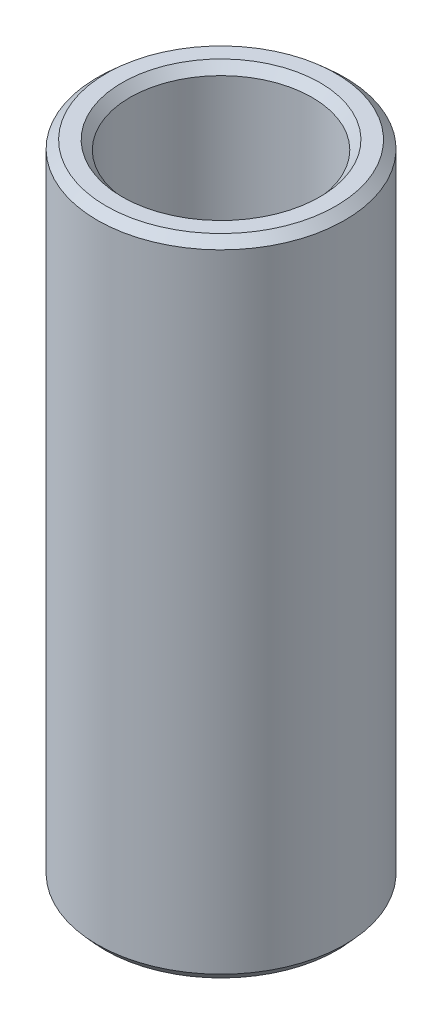
ISO-10303-21;
HEADER;
FILE_DESCRIPTION(('STEP AP214'),'2;1');
FILE_NAME('part.step','',(''),(''),'','','');
FILE_SCHEMA(('AUTOMOTIVE_DESIGN { 1 0 10303 214 1 1 1 1 }'));
ENDSEC;
DATA;
#1=APPLICATION_CONTEXT('core data for automotive mechanical design processes');
#2=APPLICATION_PROTOCOL_DEFINITION('international standard','automotive_design',2000,#1);
#3=PRODUCT_CONTEXT('',#1,'mechanical');
#4=PRODUCT('Part','Part','',(#3));
#5=PRODUCT_RELATED_PRODUCT_CATEGORY('part','',(#4));
#6=PRODUCT_DEFINITION_FORMATION('','',#4);
#7=PRODUCT_DEFINITION_CONTEXT('part definition',#1,'design');
#8=PRODUCT_DEFINITION('design','',#6,#7);
#9=PRODUCT_DEFINITION_SHAPE('','',#8);
#10=(LENGTH_UNIT() NAMED_UNIT(*) SI_UNIT(.MILLI.,.METRE.));
#11=(NAMED_UNIT(*) PLANE_ANGLE_UNIT() SI_UNIT($,.RADIAN.));
#12=(NAMED_UNIT(*) SI_UNIT($,.STERADIAN.) SOLID_ANGLE_UNIT());
#13=UNCERTAINTY_MEASURE_WITH_UNIT(LENGTH_MEASURE(1.E-05),#10,'distance_accuracy_value','');
#14=(GEOMETRIC_REPRESENTATION_CONTEXT(3) GLOBAL_UNCERTAINTY_ASSIGNED_CONTEXT((#13)) GLOBAL_UNIT_ASSIGNED_CONTEXT((#10,
#11,#12)) REPRESENTATION_CONTEXT('',''));
#15=CARTESIAN_POINT('',(0.,0.,0.));
#16=DIRECTION('',(0.,0.,1.));
#17=DIRECTION('',(1.,0.,0.));
#18=AXIS2_PLACEMENT_3D('',#15,#16,#17);
#19=CARTESIAN_POINT('',(0.,286.31339957584,0.));
#20=DIRECTION('',(0.,-1.,0.));
#21=DIRECTION('',(0.,0.,-1.));
#22=AXIS2_PLACEMENT_3D('',#19,#20,#21);
#23=CYLINDRICAL_SURFACE('',#22,55.);
#24=CARTESIAN_POINT('',(0.,3.92444573399153,0.));
#25=DIRECTION('',(0.,1.,0.));
#26=DIRECTION('',(0.,0.,1.));
#27=AXIS2_PLACEMENT_3D('',#24,#25,#26);
#28=CIRCLE('',#27,55.);
#29=CARTESIAN_POINT('',(0.,3.92444573399153,55.));
#30=VERTEX_POINT('',#29);
#31=EDGE_CURVE('E10',#30,#30,#28,.T.);
#32=ORIENTED_EDGE('',*,*,#31,.T.);
#33=EDGE_LOOP('',(#32));
#34=FACE_BOUND('',#33,.T.);
#35=CARTESIAN_POINT('',(0.,282.804681832681,0.));
#36=DIRECTION('',(0.,1.,0.));
#37=DIRECTION('',(0.,0.,1.));
#38=AXIS2_PLACEMENT_3D('',#35,#36,#37);
#39=CIRCLE('',#38,55.);
#40=CARTESIAN_POINT('',(0.,282.804681832681,55.));
#41=VERTEX_POINT('',#40);
#42=EDGE_CURVE('E50',#41,#41,#39,.F.);
#43=ORIENTED_EDGE('',*,*,#42,.T.);
#44=EDGE_LOOP('',(#43));
#45=FACE_BOUND('',#44,.T.);
#46=ADVANCED_FACE('F39',(#34,#45),#23,.T.);
#47=CARTESIAN_POINT('',(0.,286.31339957584,0.));
#48=DIRECTION('',(0.,1.,0.));
#49=DIRECTION('',(0.,0.,1.));
#50=AXIS2_PLACEMENT_3D('',#47,#48,#49);
#51=PLANE('',#50);
#52=CARTESIAN_POINT('',(0.,286.31339957584,0.));
#53=DIRECTION('',(0.,1.,0.));
#54=DIRECTION('',(0.,0.,1.));
#55=AXIS2_PLACEMENT_3D('',#52,#53,#54);
#56=CIRCLE('',#55,43.9866323589697);
#57=CARTESIAN_POINT('',(0.,286.31339957584,43.9866323589697));
#58=VERTEX_POINT('',#57);
#59=EDGE_CURVE('E58',#58,#58,#56,.F.);
#60=ORIENTED_EDGE('',*,*,#59,.T.);
#61=EDGE_LOOP('',(#60));
#62=FACE_BOUND('',#61,.T.);
#63=CARTESIAN_POINT('',(0.,286.31339957584,0.));
#64=DIRECTION('',(0.,1.,0.));
#65=DIRECTION('',(0.,0.,1.));
#66=AXIS2_PLACEMENT_3D('',#63,#64,#65);
#67=CIRCLE('',#66,51.0755542660083);
#68=CARTESIAN_POINT('',(0.,286.31339957584,51.0755542660083));
#69=VERTEX_POINT('',#68);
#70=EDGE_CURVE('E61',#69,#69,#67,.T.);
#71=ORIENTED_EDGE('',*,*,#70,.T.);
#72=EDGE_LOOP('',(#71));
#73=FACE_BOUND('',#72,.T.);
#74=ADVANCED_FACE('F88',(#62,#73),#51,.T.);
#75=CARTESIAN_POINT('',(0.,0.,0.));
#76=DIRECTION('',(0.,1.,0.));
#77=DIRECTION('',(0.,0.,1.));
#78=AXIS2_PLACEMENT_3D('',#75,#76,#77);
#79=PLANE('',#78);
#80=CARTESIAN_POINT('',(0.,0.,0.));
#81=DIRECTION('',(0.,1.,0.));
#82=DIRECTION('',(0.,0.,1.));
#83=AXIS2_PLACEMENT_3D('',#80,#81,#82);
#84=CIRCLE('',#83,44.4023603498021);
#85=CARTESIAN_POINT('',(0.,0.,44.4023603498021));
#86=VERTEX_POINT('',#85);
#87=EDGE_CURVE('E51',#86,#86,#84,.T.);
#88=ORIENTED_EDGE('',*,*,#87,.T.);
#89=EDGE_LOOP('',(#88));
#90=FACE_BOUND('',#89,.T.);
#91=CARTESIAN_POINT('',(0.,0.,0.));
#92=DIRECTION('',(0.,1.,0.));
#93=DIRECTION('',(0.,0.,1.));
#94=AXIS2_PLACEMENT_3D('',#91,#92,#93);
#95=CIRCLE('',#94,51.4912822568408);
#96=CARTESIAN_POINT('',(0.,0.,51.4912822568408));
#97=VERTEX_POINT('',#96);
#98=EDGE_CURVE('E54',#97,#97,#95,.F.);
#99=ORIENTED_EDGE('',*,*,#98,.T.);
#100=EDGE_LOOP('',(#99));
#101=FACE_BOUND('',#100,.T.);
#102=ADVANCED_FACE('F83',(#90,#101),#79,.F.);
#103=CARTESIAN_POINT('',(0.,286.31339957584,0.));
#104=DIRECTION('',(0.,-1.,0.));
#105=DIRECTION('',(0.,0.,-1.));
#106=AXIS2_PLACEMENT_3D('',#103,#104,#105);
#107=CYLINDRICAL_SURFACE('',#106,40.4779146158104);
#108=CARTESIAN_POINT('',(0.,282.388953841849,0.));
#109=DIRECTION('',(0.,1.,0.));
#110=DIRECTION('',(0.,0.,1.));
#111=AXIS2_PLACEMENT_3D('',#108,#109,#110);
#112=CIRCLE('',#111,40.4779146158104);
#113=CARTESIAN_POINT('',(0.,282.388953841849,40.4779146158104));
#114=VERTEX_POINT('',#113);
#115=EDGE_CURVE('E67',#114,#114,#112,.T.);
#116=ORIENTED_EDGE('',*,*,#115,.T.);
#117=EDGE_LOOP('',(#116));
#118=FACE_BOUND('',#117,.T.);
#119=CARTESIAN_POINT('',(0.,3.50871774315931,0.));
#120=DIRECTION('',(0.,1.,0.));
#121=DIRECTION('',(0.,0.,1.));
#122=AXIS2_PLACEMENT_3D('',#119,#120,#121);
#123=CIRCLE('',#122,40.4779146158104);
#124=CARTESIAN_POINT('',(0.,3.50871774315931,40.4779146158104));
#125=VERTEX_POINT('',#124);
#126=EDGE_CURVE('E69',#125,#125,#123,.F.);
#127=ORIENTED_EDGE('',*,*,#126,.T.);
#128=EDGE_LOOP('',(#127));
#129=FACE_BOUND('',#128,.T.);
#130=ADVANCED_FACE('F71',(#118,#129),#107,.F.);
#131=CARTESIAN_POINT('',(0.,282.388953841849,0.));
#132=DIRECTION('',(0.,1.,0.));
#133=DIRECTION('',(0.,0.,1.));
#134=AXIS2_PLACEMENT_3D('',#131,#132,#133);
#135=CONICAL_SURFACE('',#134,40.4779146158104,0.729527559486882);
#136=ORIENTED_EDGE('',*,*,#59,.F.);
#137=EDGE_LOOP('',(#136));
#138=FACE_BOUND('',#137,.T.);
#139=ORIENTED_EDGE('',*,*,#115,.F.);
#140=EDGE_LOOP('',(#139));
#141=FACE_BOUND('',#140,.T.);
#142=ADVANCED_FACE('F77',(#138,#141),#135,.F.);
#143=CARTESIAN_POINT('',(0.,0.,0.));
#144=DIRECTION('',(0.,-1.,0.));
#145=DIRECTION('',(0.,0.,-1.));
#146=AXIS2_PLACEMENT_3D('',#143,#144,#145);
#147=CONICAL_SURFACE('',#146,44.4023603498021,0.841268767308002);
#148=ORIENTED_EDGE('',*,*,#126,.F.);
#149=EDGE_LOOP('',(#148));
#150=FACE_BOUND('',#149,.T.);
#151=ORIENTED_EDGE('',*,*,#87,.F.);
#152=EDGE_LOOP('',(#151));
#153=FACE_BOUND('',#152,.T.);
#154=ADVANCED_FACE('F73',(#150,#153),#147,.F.);
#155=CARTESIAN_POINT('',(0.,3.92444573399153,0.));
#156=DIRECTION('',(0.,1.,0.));
#157=DIRECTION('',(0.,0.,1.));
#158=AXIS2_PLACEMENT_3D('',#155,#156,#157);
#159=CONICAL_SURFACE('',#158,55.,0.729527559486897);
#160=ORIENTED_EDGE('',*,*,#98,.F.);
#161=EDGE_LOOP('',(#160));
#162=FACE_BOUND('',#161,.T.);
#163=ORIENTED_EDGE('',*,*,#31,.F.);
#164=EDGE_LOOP('',(#163));
#165=FACE_BOUND('',#164,.T.);
#166=ADVANCED_FACE('F76',(#162,#165),#159,.T.);
#167=CARTESIAN_POINT('',(0.,286.31339957584,0.));
#168=DIRECTION('',(0.,-1.,0.));
#169=DIRECTION('',(0.,0.,-1.));
#170=AXIS2_PLACEMENT_3D('',#167,#168,#169);
#171=CONICAL_SURFACE('',#170,51.0755542660083,0.841268767308009);
#172=ORIENTED_EDGE('',*,*,#42,.F.);
#173=EDGE_LOOP('',(#172));
#174=FACE_BOUND('',#173,.T.);
#175=ORIENTED_EDGE('',*,*,#70,.F.);
#176=EDGE_LOOP('',(#175));
#177=FACE_BOUND('',#176,.T.);
#178=ADVANCED_FACE('F45',(#174,#177),#171,.T.);
#179=CLOSED_SHELL('',(#46,#74,#102,#130,#142,#154,#166,#178));
#180=MANIFOLD_SOLID_BREP('B2',#179);
#181=ADVANCED_BREP_SHAPE_REPRESENTATION('',(#18,#180),#14);
#182=SHAPE_DEFINITION_REPRESENTATION(#9,#181);
ENDSEC;
END-ISO-10303-21;
